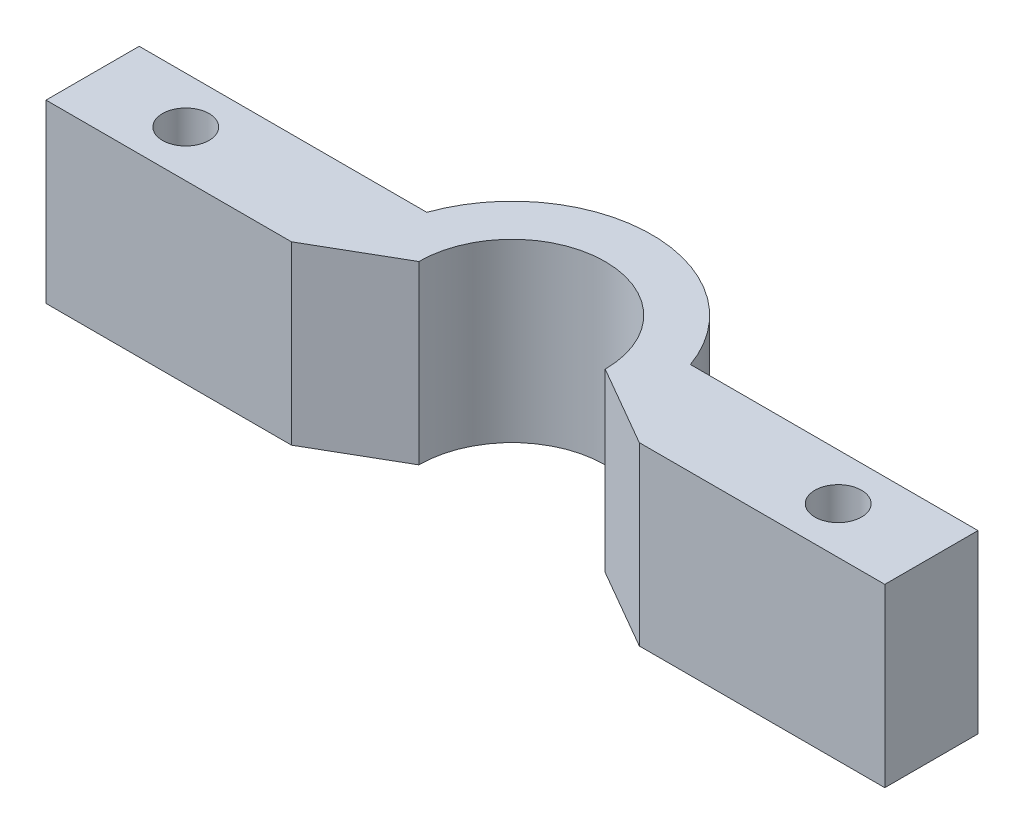
ISO-10303-21;
HEADER;
FILE_DESCRIPTION(('STEP AP214'),'2;1');
FILE_NAME('part.step','',(''),(''),'','','');
FILE_SCHEMA(('AUTOMOTIVE_DESIGN { 1 0 10303 214 1 1 1 1 }'));
ENDSEC;
DATA;
#1=APPLICATION_CONTEXT('core data for automotive mechanical design processes');
#2=APPLICATION_PROTOCOL_DEFINITION('international standard','automotive_design',2000,#1);
#3=PRODUCT_CONTEXT('',#1,'mechanical');
#4=PRODUCT('Part','Part','',(#3));
#5=PRODUCT_RELATED_PRODUCT_CATEGORY('part','',(#4));
#6=PRODUCT_DEFINITION_FORMATION('','',#4);
#7=PRODUCT_DEFINITION_CONTEXT('part definition',#1,'design');
#8=PRODUCT_DEFINITION('design','',#6,#7);
#9=PRODUCT_DEFINITION_SHAPE('','',#8);
#10=(LENGTH_UNIT() NAMED_UNIT(*) SI_UNIT(.MILLI.,.METRE.));
#11=(NAMED_UNIT(*) PLANE_ANGLE_UNIT() SI_UNIT($,.RADIAN.));
#12=(NAMED_UNIT(*) SI_UNIT($,.STERADIAN.) SOLID_ANGLE_UNIT());
#13=UNCERTAINTY_MEASURE_WITH_UNIT(LENGTH_MEASURE(1.E-05),#10,'distance_accuracy_value','');
#14=(GEOMETRIC_REPRESENTATION_CONTEXT(3) GLOBAL_UNCERTAINTY_ASSIGNED_CONTEXT((#13)) GLOBAL_UNIT_ASSIGNED_CONTEXT((#10,
#11,#12)) REPRESENTATION_CONTEXT('',''));
#15=CARTESIAN_POINT('',(0.,0.,0.));
#16=DIRECTION('',(0.,0.,1.));
#17=DIRECTION('',(1.,0.,0.));
#18=AXIS2_PLACEMENT_3D('',#15,#16,#17);
#19=CARTESIAN_POINT('',(-0.793750000000001,3.,-1.3748153285078));
#20=DIRECTION('',(0.5,0.,0.866025403784438));
#21=DIRECTION('',(0.866025403784439,0.,-0.5));
#22=AXIS2_PLACEMENT_3D('',#19,#20,#21);
#23=PLANE('',#22);
#24=DIRECTION('',(-0.866025403784439,0.,0.5));
#25=VECTOR('',#24,1.);
#26=CARTESIAN_POINT('',(-0.793750000000001,-3.,-1.3748153285078));
#27=LINE('',#26,#25);
#28=CARTESIAN_POINT('',(-3.175,-3.,0.));
#29=VERTEX_POINT('',#28);
#30=CARTESIAN_POINT('',(-5.9246306570156,-3.,1.5875));
#31=VERTEX_POINT('',#30);
#32=EDGE_CURVE('E161',#29,#31,#27,.T.);
#33=ORIENTED_EDGE('',*,*,#32,.F.);
#34=DIRECTION('',(0.,-1.,0.));
#35=VECTOR('',#34,1.);
#36=CARTESIAN_POINT('',(-3.175,3.,0.));
#37=LINE('',#36,#35);
#38=CARTESIAN_POINT('',(-3.175,3.,0.));
#39=VERTEX_POINT('',#38);
#40=EDGE_CURVE('E11',#39,#29,#37,.T.);
#41=ORIENTED_EDGE('',*,*,#40,.F.);
#42=DIRECTION('',(-0.866025403784439,0.,0.5));
#43=VECTOR('',#42,1.);
#44=CARTESIAN_POINT('',(-0.793750000000001,3.,-1.3748153285078));
#45=LINE('',#44,#43);
#46=CARTESIAN_POINT('',(-5.9246306570156,3.,1.5875));
#47=VERTEX_POINT('',#46);
#48=EDGE_CURVE('E249',#39,#47,#45,.T.);
#49=ORIENTED_EDGE('',*,*,#48,.T.);
#50=DIRECTION('',(0.,-1.,0.));
#51=VECTOR('',#50,1.);
#52=CARTESIAN_POINT('',(-5.9246306570156,3.,1.5875));
#53=LINE('',#52,#51);
#54=EDGE_CURVE('E99',#47,#31,#53,.T.);
#55=ORIENTED_EDGE('',*,*,#54,.T.);
#56=EDGE_LOOP('',(#33,#41,#49,#55));
#57=FACE_BOUND('',#56,.T.);
#58=ADVANCED_FACE('F41',(#57),#23,.T.);
#59=CARTESIAN_POINT('',(0.,3.,0.));
#60=DIRECTION('',(0.,-1.,0.));
#61=DIRECTION('',(0.,0.,-1.));
#62=AXIS2_PLACEMENT_3D('',#59,#60,#61);
#63=CYLINDRICAL_SURFACE('',#62,3.175);
#64=CARTESIAN_POINT('',(0.,-3.,0.));
#65=DIRECTION('',(0.,1.,0.));
#66=DIRECTION('',(0.,0.,1.));
#67=AXIS2_PLACEMENT_3D('',#64,#65,#66);
#68=CIRCLE('',#67,3.175);
#69=CARTESIAN_POINT('',(3.175,-3.,0.));
#70=VERTEX_POINT('',#69);
#71=EDGE_CURVE('E165',#70,#29,#68,.T.);
#72=ORIENTED_EDGE('',*,*,#71,.F.);
#73=DIRECTION('',(0.,-1.,0.));
#74=VECTOR('',#73,1.);
#75=CARTESIAN_POINT('',(3.175,3.,0.));
#76=LINE('',#75,#74);
#77=CARTESIAN_POINT('',(3.175,3.,0.));
#78=VERTEX_POINT('',#77);
#79=EDGE_CURVE('E51',#78,#70,#76,.T.);
#80=ORIENTED_EDGE('',*,*,#79,.F.);
#81=CARTESIAN_POINT('',(0.,3.,0.));
#82=DIRECTION('',(0.,1.,0.));
#83=DIRECTION('',(0.,0.,1.));
#84=AXIS2_PLACEMENT_3D('',#81,#82,#83);
#85=CIRCLE('',#84,3.175);
#86=EDGE_CURVE('E245',#78,#39,#85,.T.);
#87=ORIENTED_EDGE('',*,*,#86,.T.);
#88=ORIENTED_EDGE('',*,*,#40,.T.);
#89=EDGE_LOOP('',(#72,#80,#87,#88));
#90=FACE_BOUND('',#89,.T.);
#91=ADVANCED_FACE('F231',(#90),#63,.F.);
#92=CARTESIAN_POINT('',(0.793750000000001,3.,-1.3748153285078));
#93=DIRECTION('',(-0.5,0.,0.866025403784438));
#94=DIRECTION('',(0.866025403784439,0.,0.5));
#95=AXIS2_PLACEMENT_3D('',#92,#93,#94);
#96=PLANE('',#95);
#97=DIRECTION('',(-0.866025403784439,0.,-0.5));
#98=VECTOR('',#97,1.);
#99=CARTESIAN_POINT('',(0.793750000000001,-3.,-1.3748153285078));
#100=LINE('',#99,#98);
#101=CARTESIAN_POINT('',(5.92463065701559,-3.,1.5875));
#102=VERTEX_POINT('',#101);
#103=EDGE_CURVE('E169',#102,#70,#100,.T.);
#104=ORIENTED_EDGE('',*,*,#103,.F.);
#105=DIRECTION('',(0.,-1.,0.));
#106=VECTOR('',#105,1.);
#107=CARTESIAN_POINT('',(5.92463065701559,3.,1.5875));
#108=LINE('',#107,#106);
#109=CARTESIAN_POINT('',(5.92463065701559,3.,1.5875));
#110=VERTEX_POINT('',#109);
#111=EDGE_CURVE('E218',#110,#102,#108,.T.);
#112=ORIENTED_EDGE('',*,*,#111,.F.);
#113=DIRECTION('',(-0.866025403784439,0.,-0.5));
#114=VECTOR('',#113,1.);
#115=CARTESIAN_POINT('',(0.793750000000001,3.,-1.3748153285078));
#116=LINE('',#115,#114);
#117=EDGE_CURVE('E227',#110,#78,#116,.T.);
#118=ORIENTED_EDGE('',*,*,#117,.T.);
#119=ORIENTED_EDGE('',*,*,#79,.T.);
#120=EDGE_LOOP('',(#104,#112,#118,#119));
#121=FACE_BOUND('',#120,.T.);
#122=ADVANCED_FACE('F225',(#121),#96,.T.);
#123=CARTESIAN_POINT('',(0.,3.,1.5875));
#124=DIRECTION('',(0.,0.,-1.));
#125=DIRECTION('',(-1.,0.,0.));
#126=AXIS2_PLACEMENT_3D('',#123,#124,#125);
#127=PLANE('',#126);
#128=DIRECTION('',(1.,0.,0.));
#129=VECTOR('',#128,1.);
#130=CARTESIAN_POINT('',(0.,-3.,1.5875));
#131=LINE('',#130,#129);
#132=CARTESIAN_POINT('',(14.2875,-3.,1.5875));
#133=VERTEX_POINT('',#132);
#134=EDGE_CURVE('E173',#102,#133,#131,.T.);
#135=ORIENTED_EDGE('',*,*,#134,.T.);
#136=DIRECTION('',(0.,-1.,0.));
#137=VECTOR('',#136,1.);
#138=CARTESIAN_POINT('',(14.2875,3.,1.5875));
#139=LINE('',#138,#137);
#140=CARTESIAN_POINT('',(14.2875,3.,1.5875));
#141=VERTEX_POINT('',#140);
#142=EDGE_CURVE('E214',#141,#133,#139,.T.);
#143=ORIENTED_EDGE('',*,*,#142,.F.);
#144=DIRECTION('',(1.,0.,0.));
#145=VECTOR('',#144,1.);
#146=CARTESIAN_POINT('',(0.,3.,1.5875));
#147=LINE('',#146,#145);
#148=EDGE_CURVE('E241',#110,#141,#147,.T.);
#149=ORIENTED_EDGE('',*,*,#148,.F.);
#150=ORIENTED_EDGE('',*,*,#111,.T.);
#151=EDGE_LOOP('',(#135,#143,#149,#150));
#152=FACE_BOUND('',#151,.T.);
#153=ADVANCED_FACE('F238',(#152),#127,.F.);
#154=CARTESIAN_POINT('',(14.2875,3.,0.));
#155=DIRECTION('',(-1.,0.,0.));
#156=DIRECTION('',(0.,0.,1.));
#157=AXIS2_PLACEMENT_3D('',#154,#155,#156);
#158=PLANE('',#157);
#159=DIRECTION('',(0.,0.,-1.));
#160=VECTOR('',#159,1.);
#161=CARTESIAN_POINT('',(14.2875,-3.,0.));
#162=LINE('',#161,#160);
#163=CARTESIAN_POINT('',(14.2875,-3.,-1.5875));
#164=VERTEX_POINT('',#163);
#165=EDGE_CURVE('E177',#133,#164,#162,.T.);
#166=ORIENTED_EDGE('',*,*,#165,.T.);
#167=DIRECTION('',(0.,-1.,0.));
#168=VECTOR('',#167,1.);
#169=CARTESIAN_POINT('',(14.2875,3.,-1.5875));
#170=LINE('',#169,#168);
#171=CARTESIAN_POINT('',(14.2875,3.,-1.5875));
#172=VERTEX_POINT('',#171);
#173=EDGE_CURVE('E211',#172,#164,#170,.T.);
#174=ORIENTED_EDGE('',*,*,#173,.F.);
#175=DIRECTION('',(0.,0.,-1.));
#176=VECTOR('',#175,1.);
#177=CARTESIAN_POINT('',(14.2875,3.,0.));
#178=LINE('',#177,#176);
#179=EDGE_CURVE('E243',#141,#172,#178,.T.);
#180=ORIENTED_EDGE('',*,*,#179,.F.);
#181=ORIENTED_EDGE('',*,*,#142,.T.);
#182=EDGE_LOOP('',(#166,#174,#180,#181));
#183=FACE_BOUND('',#182,.T.);
#184=ADVANCED_FACE('F264',(#183),#158,.F.);
#185=CARTESIAN_POINT('',(0.,3.,-1.5875));
#186=DIRECTION('',(0.,0.,-1.));
#187=DIRECTION('',(-1.,0.,0.));
#188=AXIS2_PLACEMENT_3D('',#185,#186,#187);
#189=PLANE('',#188);
#190=DIRECTION('',(1.,0.,0.));
#191=VECTOR('',#190,1.);
#192=CARTESIAN_POINT('',(0.,-3.,-1.5875));
#193=LINE('',#192,#191);
#194=CARTESIAN_POINT('',(4.49012806053458,-3.,-1.5875));
#195=VERTEX_POINT('',#194);
#196=EDGE_CURVE('E181',#195,#164,#193,.T.);
#197=ORIENTED_EDGE('',*,*,#196,.F.);
#198=DIRECTION('',(0.,-1.,0.));
#199=VECTOR('',#198,1.);
#200=CARTESIAN_POINT('',(4.49012806053458,3.,-1.5875));
#201=LINE('',#200,#199);
#202=CARTESIAN_POINT('',(4.49012806053458,3.,-1.5875));
#203=VERTEX_POINT('',#202);
#204=EDGE_CURVE('E208',#203,#195,#201,.T.);
#205=ORIENTED_EDGE('',*,*,#204,.F.);
#206=DIRECTION('',(1.,0.,0.));
#207=VECTOR('',#206,1.);
#208=CARTESIAN_POINT('',(0.,3.,-1.5875));
#209=LINE('',#208,#207);
#210=EDGE_CURVE('E255',#203,#172,#209,.T.);
#211=ORIENTED_EDGE('',*,*,#210,.T.);
#212=ORIENTED_EDGE('',*,*,#173,.T.);
#213=EDGE_LOOP('',(#197,#205,#211,#212));
#214=FACE_BOUND('',#213,.T.);
#215=ADVANCED_FACE('F261',(#214),#189,.T.);
#216=CARTESIAN_POINT('',(0.,3.,0.));
#217=DIRECTION('',(0.,-1.,0.));
#218=DIRECTION('',(0.,0.,-1.));
#219=AXIS2_PLACEMENT_3D('',#216,#217,#218);
#220=CYLINDRICAL_SURFACE('',#219,4.7625);
#221=CARTESIAN_POINT('',(0.,-3.,0.));
#222=DIRECTION('',(0.,1.,0.));
#223=DIRECTION('',(0.,0.,1.));
#224=AXIS2_PLACEMENT_3D('',#221,#222,#223);
#225=CIRCLE('',#224,4.7625);
#226=CARTESIAN_POINT('',(-4.49012806053458,-3.,-1.5875));
#227=VERTEX_POINT('',#226);
#228=EDGE_CURVE('E185',#195,#227,#225,.T.);
#229=ORIENTED_EDGE('',*,*,#228,.T.);
#230=DIRECTION('',(0.,-1.,0.));
#231=VECTOR('',#230,1.);
#232=CARTESIAN_POINT('',(-4.49012806053458,3.,-1.5875));
#233=LINE('',#232,#231);
#234=CARTESIAN_POINT('',(-4.49012806053458,3.,-1.5875));
#235=VERTEX_POINT('',#234);
#236=EDGE_CURVE('E135',#235,#227,#233,.T.);
#237=ORIENTED_EDGE('',*,*,#236,.F.);
#238=CARTESIAN_POINT('',(0.,3.,0.));
#239=DIRECTION('',(0.,1.,0.));
#240=DIRECTION('',(0.,0.,1.));
#241=AXIS2_PLACEMENT_3D('',#238,#239,#240);
#242=CIRCLE('',#241,4.7625);
#243=EDGE_CURVE('E142',#203,#235,#242,.T.);
#244=ORIENTED_EDGE('',*,*,#243,.F.);
#245=ORIENTED_EDGE('',*,*,#204,.T.);
#246=EDGE_LOOP('',(#229,#237,#244,#245));
#247=FACE_BOUND('',#246,.T.);
#248=ADVANCED_FACE('F267',(#247),#220,.T.);
#249=CARTESIAN_POINT('',(0.,3.,-1.5875));
#250=DIRECTION('',(0.,0.,-1.));
#251=DIRECTION('',(-1.,0.,0.));
#252=AXIS2_PLACEMENT_3D('',#249,#250,#251);
#253=PLANE('',#252);
#254=DIRECTION('',(1.,0.,0.));
#255=VECTOR('',#254,1.);
#256=CARTESIAN_POINT('',(0.,-3.,-1.5875));
#257=LINE('',#256,#255);
#258=CARTESIAN_POINT('',(-14.2875,-3.,-1.5875));
#259=VERTEX_POINT('',#258);
#260=EDGE_CURVE('E129',#259,#227,#257,.T.);
#261=ORIENTED_EDGE('',*,*,#260,.F.);
#262=DIRECTION('',(0.,-1.,0.));
#263=VECTOR('',#262,1.);
#264=CARTESIAN_POINT('',(-14.2875,3.,-1.5875));
#265=LINE('',#264,#263);
#266=CARTESIAN_POINT('',(-14.2875,3.,-1.5875));
#267=VERTEX_POINT('',#266);
#268=EDGE_CURVE('E124',#267,#259,#265,.T.);
#269=ORIENTED_EDGE('',*,*,#268,.F.);
#270=DIRECTION('',(1.,0.,0.));
#271=VECTOR('',#270,1.);
#272=CARTESIAN_POINT('',(0.,3.,-1.5875));
#273=LINE('',#272,#271);
#274=EDGE_CURVE('E127',#267,#235,#273,.T.);
#275=ORIENTED_EDGE('',*,*,#274,.T.);
#276=ORIENTED_EDGE('',*,*,#236,.T.);
#277=EDGE_LOOP('',(#261,#269,#275,#276));
#278=FACE_BOUND('',#277,.T.);
#279=ADVANCED_FACE('F126',(#278),#253,.T.);
#280=CARTESIAN_POINT('',(-14.2875,3.,0.));
#281=DIRECTION('',(-1.,0.,0.));
#282=DIRECTION('',(0.,0.,1.));
#283=AXIS2_PLACEMENT_3D('',#280,#281,#282);
#284=PLANE('',#283);
#285=DIRECTION('',(0.,0.,-1.));
#286=VECTOR('',#285,1.);
#287=CARTESIAN_POINT('',(-14.2875,-3.,0.));
#288=LINE('',#287,#286);
#289=CARTESIAN_POINT('',(-14.2875,-3.,1.5875));
#290=VERTEX_POINT('',#289);
#291=EDGE_CURVE('E191',#290,#259,#288,.T.);
#292=ORIENTED_EDGE('',*,*,#291,.F.);
#293=DIRECTION('',(0.,-1.,0.));
#294=VECTOR('',#293,1.);
#295=CARTESIAN_POINT('',(-14.2875,3.,1.5875));
#296=LINE('',#295,#294);
#297=CARTESIAN_POINT('',(-14.2875,3.,1.5875));
#298=VERTEX_POINT('',#297);
#299=EDGE_CURVE('E92',#298,#290,#296,.T.);
#300=ORIENTED_EDGE('',*,*,#299,.F.);
#301=DIRECTION('',(0.,0.,-1.));
#302=VECTOR('',#301,1.);
#303=CARTESIAN_POINT('',(-14.2875,3.,0.));
#304=LINE('',#303,#302);
#305=EDGE_CURVE('E139',#298,#267,#304,.T.);
#306=ORIENTED_EDGE('',*,*,#305,.T.);
#307=ORIENTED_EDGE('',*,*,#268,.T.);
#308=EDGE_LOOP('',(#292,#300,#306,#307));
#309=FACE_BOUND('',#308,.T.);
#310=ADVANCED_FACE('F146',(#309),#284,.T.);
#311=CARTESIAN_POINT('',(0.,3.,1.5875));
#312=DIRECTION('',(0.,0.,-1.));
#313=DIRECTION('',(-1.,0.,0.));
#314=AXIS2_PLACEMENT_3D('',#311,#312,#313);
#315=PLANE('',#314);
#316=DIRECTION('',(1.,0.,0.));
#317=VECTOR('',#316,1.);
#318=CARTESIAN_POINT('',(0.,-3.,1.5875));
#319=LINE('',#318,#317);
#320=EDGE_CURVE('E194',#290,#31,#319,.T.);
#321=ORIENTED_EDGE('',*,*,#320,.T.);
#322=ORIENTED_EDGE('',*,*,#54,.F.);
#323=DIRECTION('',(1.,0.,0.));
#324=VECTOR('',#323,1.);
#325=CARTESIAN_POINT('',(0.,3.,1.5875));
#326=LINE('',#325,#324);
#327=EDGE_CURVE('E59',#298,#47,#326,.T.);
#328=ORIENTED_EDGE('',*,*,#327,.F.);
#329=ORIENTED_EDGE('',*,*,#299,.T.);
#330=EDGE_LOOP('',(#321,#322,#328,#329));
#331=FACE_BOUND('',#330,.T.);
#332=ADVANCED_FACE('F314',(#331),#315,.F.);
#333=CARTESIAN_POINT('',(-11.1125,3.,0.));
#334=DIRECTION('',(0.,-1.,0.));
#335=DIRECTION('',(0.,0.,-1.));
#336=AXIS2_PLACEMENT_3D('',#333,#334,#335);
#337=CYLINDRICAL_SURFACE('',#336,0.793749999999999);
#338=CARTESIAN_POINT('',(-11.1125,3.,0.));
#339=DIRECTION('',(0.,1.,0.));
#340=DIRECTION('',(0.,0.,1.));
#341=AXIS2_PLACEMENT_3D('',#338,#339,#340);
#342=CIRCLE('',#341,0.793749999999999);
#343=CARTESIAN_POINT('',(-11.1125,3.,0.793749999999999));
#344=VERTEX_POINT('',#343);
#345=EDGE_CURVE('E201',#344,#344,#342,.T.);
#346=ORIENTED_EDGE('',*,*,#345,.T.);
#347=EDGE_LOOP('',(#346));
#348=FACE_BOUND('',#347,.T.);
#349=CARTESIAN_POINT('',(-11.1125,-3.,0.));
#350=DIRECTION('',(0.,1.,0.));
#351=DIRECTION('',(0.,0.,1.));
#352=AXIS2_PLACEMENT_3D('',#349,#350,#351);
#353=CIRCLE('',#352,0.793749999999999);
#354=CARTESIAN_POINT('',(-11.1125,-3.,0.793749999999999));
#355=VERTEX_POINT('',#354);
#356=EDGE_CURVE('E157',#355,#355,#353,.T.);
#357=ORIENTED_EDGE('',*,*,#356,.F.);
#358=EDGE_LOOP('',(#357));
#359=FACE_BOUND('',#358,.T.);
#360=ADVANCED_FACE('F43',(#348,#359),#337,.F.);
#361=CARTESIAN_POINT('',(11.1125,3.,0.));
#362=DIRECTION('',(0.,-1.,0.));
#363=DIRECTION('',(0.,0.,-1.));
#364=AXIS2_PLACEMENT_3D('',#361,#362,#363);
#365=CYLINDRICAL_SURFACE('',#364,0.793749999999999);
#366=CARTESIAN_POINT('',(11.1125,3.,0.));
#367=DIRECTION('',(0.,1.,0.));
#368=DIRECTION('',(0.,0.,1.));
#369=AXIS2_PLACEMENT_3D('',#366,#367,#368);
#370=CIRCLE('',#369,0.793749999999999);
#371=CARTESIAN_POINT('',(11.1125,3.,0.793749999999999));
#372=VERTEX_POINT('',#371);
#373=EDGE_CURVE('E150',#372,#372,#370,.T.);
#374=ORIENTED_EDGE('',*,*,#373,.T.);
#375=EDGE_LOOP('',(#374));
#376=FACE_BOUND('',#375,.T.);
#377=CARTESIAN_POINT('',(11.1125,-3.,0.));
#378=DIRECTION('',(0.,1.,0.));
#379=DIRECTION('',(0.,0.,1.));
#380=AXIS2_PLACEMENT_3D('',#377,#378,#379);
#381=CIRCLE('',#380,0.793749999999999);
#382=CARTESIAN_POINT('',(11.1125,-3.,0.793749999999999));
#383=VERTEX_POINT('',#382);
#384=EDGE_CURVE('E197',#383,#383,#381,.T.);
#385=ORIENTED_EDGE('',*,*,#384,.F.);
#386=EDGE_LOOP('',(#385));
#387=FACE_BOUND('',#386,.T.);
#388=ADVANCED_FACE('F331',(#376,#387),#365,.F.);
#389=CARTESIAN_POINT('',(0.,3.,0.));
#390=DIRECTION('',(0.,1.,0.));
#391=DIRECTION('',(0.,0.,1.));
#392=AXIS2_PLACEMENT_3D('',#389,#390,#391);
#393=PLANE('',#392);
#394=ORIENTED_EDGE('',*,*,#345,.F.);
#395=EDGE_LOOP('',(#394));
#396=FACE_BOUND('',#395,.T.);
#397=ORIENTED_EDGE('',*,*,#48,.F.);
#398=ORIENTED_EDGE('',*,*,#86,.F.);
#399=ORIENTED_EDGE('',*,*,#117,.F.);
#400=ORIENTED_EDGE('',*,*,#148,.T.);
#401=ORIENTED_EDGE('',*,*,#179,.T.);
#402=ORIENTED_EDGE('',*,*,#210,.F.);
#403=ORIENTED_EDGE('',*,*,#243,.T.);
#404=ORIENTED_EDGE('',*,*,#274,.F.);
#405=ORIENTED_EDGE('',*,*,#305,.F.);
#406=ORIENTED_EDGE('',*,*,#327,.T.);
#407=EDGE_LOOP('',(#397,#398,#399,#400,#401,#402,#403,#404,#405,#406));
#408=FACE_BOUND('',#407,.T.);
#409=ORIENTED_EDGE('',*,*,#373,.F.);
#410=EDGE_LOOP('',(#409));
#411=FACE_BOUND('',#410,.T.);
#412=ADVANCED_FACE('F137',(#396,#408,#411),#393,.T.);
#413=CARTESIAN_POINT('',(0.,-3.,0.));
#414=DIRECTION('',(0.,1.,0.));
#415=DIRECTION('',(0.,0.,1.));
#416=AXIS2_PLACEMENT_3D('',#413,#414,#415);
#417=PLANE('',#416);
#418=ORIENTED_EDGE('',*,*,#356,.T.);
#419=EDGE_LOOP('',(#418));
#420=FACE_BOUND('',#419,.T.);
#421=ORIENTED_EDGE('',*,*,#32,.T.);
#422=ORIENTED_EDGE('',*,*,#320,.F.);
#423=ORIENTED_EDGE('',*,*,#291,.T.);
#424=ORIENTED_EDGE('',*,*,#260,.T.);
#425=ORIENTED_EDGE('',*,*,#228,.F.);
#426=ORIENTED_EDGE('',*,*,#196,.T.);
#427=ORIENTED_EDGE('',*,*,#165,.F.);
#428=ORIENTED_EDGE('',*,*,#134,.F.);
#429=ORIENTED_EDGE('',*,*,#103,.T.);
#430=ORIENTED_EDGE('',*,*,#71,.T.);
#431=EDGE_LOOP('',(#421,#422,#423,#424,#425,#426,#427,#428,#429,#430));
#432=FACE_BOUND('',#431,.T.);
#433=ORIENTED_EDGE('',*,*,#384,.T.);
#434=EDGE_LOOP('',(#433));
#435=FACE_BOUND('',#434,.T.);
#436=ADVANCED_FACE('F234',(#420,#432,#435),#417,.F.);
#437=CLOSED_SHELL('',(#58,#91,#122,#153,#184,#215,#248,#279,#310,#332,#360,#388,#412,#436));
#438=MANIFOLD_SOLID_BREP('B2',#437);
#439=ADVANCED_BREP_SHAPE_REPRESENTATION('',(#18,#438),#14);
#440=SHAPE_DEFINITION_REPRESENTATION(#9,#439);
ENDSEC;
END-ISO-10303-21;
